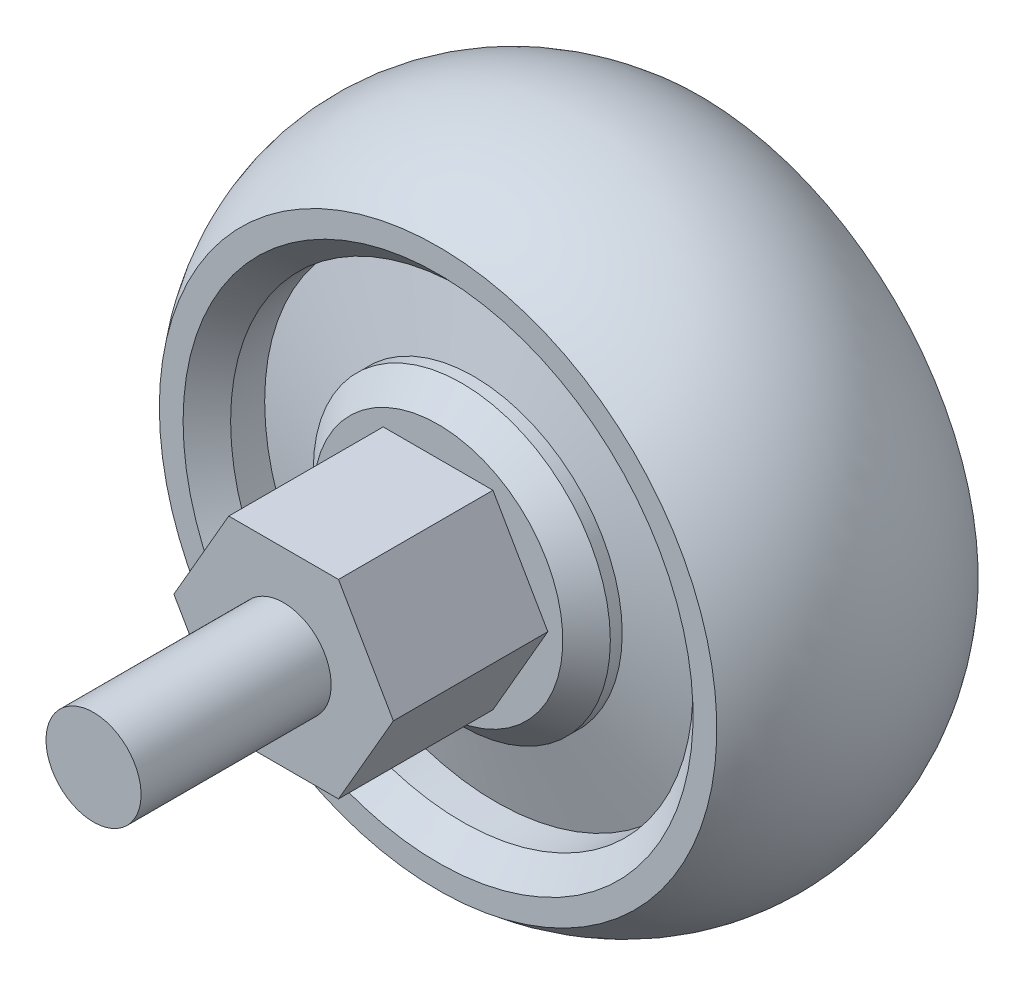
ISO-10303-21;
HEADER;
FILE_DESCRIPTION(('STEP AP214'),'2;1');
FILE_NAME('part.step','',(''),(''),'','','');
FILE_SCHEMA(('AUTOMOTIVE_DESIGN { 1 0 10303 214 1 1 1 1 }'));
ENDSEC;
DATA;
#1=APPLICATION_CONTEXT('core data for automotive mechanical design processes');
#2=APPLICATION_PROTOCOL_DEFINITION('international standard','automotive_design',2000,#1);
#3=PRODUCT_CONTEXT('',#1,'mechanical');
#4=PRODUCT('Part','Part','',(#3));
#5=PRODUCT_RELATED_PRODUCT_CATEGORY('part','',(#4));
#6=PRODUCT_DEFINITION_FORMATION('','',#4);
#7=PRODUCT_DEFINITION_CONTEXT('part definition',#1,'design');
#8=PRODUCT_DEFINITION('design','',#6,#7);
#9=PRODUCT_DEFINITION_SHAPE('','',#8);
#10=(LENGTH_UNIT() NAMED_UNIT(*) SI_UNIT(.MILLI.,.METRE.));
#11=(NAMED_UNIT(*) PLANE_ANGLE_UNIT() SI_UNIT($,.RADIAN.));
#12=(NAMED_UNIT(*) SI_UNIT($,.STERADIAN.) SOLID_ANGLE_UNIT());
#13=UNCERTAINTY_MEASURE_WITH_UNIT(LENGTH_MEASURE(1.E-05),#10,'distance_accuracy_value','');
#14=(GEOMETRIC_REPRESENTATION_CONTEXT(3) GLOBAL_UNCERTAINTY_ASSIGNED_CONTEXT((#13)) GLOBAL_UNIT_ASSIGNED_CONTEXT((#10,
#11,#12)) REPRESENTATION_CONTEXT('',''));
#15=CARTESIAN_POINT('',(0.,0.,0.));
#16=DIRECTION('',(0.,0.,1.));
#17=DIRECTION('',(1.,0.,0.));
#18=AXIS2_PLACEMENT_3D('',#15,#16,#17);
#19=CARTESIAN_POINT('',(0.,0.,0.));
#20=DIRECTION('',(0.,0.,-1.));
#21=DIRECTION('',(-1.,0.,0.));
#22=AXIS2_PLACEMENT_3D('',#19,#20,#21);
#23=CYLINDRICAL_SURFACE('',#22,24.716081373956);
#24=CARTESIAN_POINT('',(0.,0.,7.79103938563071));
#25=DIRECTION('',(0.,0.,-1.));
#26=DIRECTION('',(-1.,0.,0.));
#27=AXIS2_PLACEMENT_3D('',#24,#25,#26);
#28=CIRCLE('',#27,24.716081373956);
#29=CARTESIAN_POINT('',(-24.716081373956,0.,7.79103938563071));
#30=VERTEX_POINT('',#29);
#31=EDGE_CURVE('E170',#30,#30,#28,.T.);
#32=ORIENTED_EDGE('',*,*,#31,.T.);
#33=EDGE_LOOP('',(#32));
#34=FACE_BOUND('',#33,.T.);
#35=CARTESIAN_POINT('',(0.,0.,11.43));
#36=DIRECTION('',(0.,0.,-1.));
#37=DIRECTION('',(-1.,0.,0.));
#38=AXIS2_PLACEMENT_3D('',#35,#36,#37);
#39=CIRCLE('',#38,24.716081373956);
#40=CARTESIAN_POINT('',(-24.716081373956,0.,11.43));
#41=VERTEX_POINT('',#40);
#42=EDGE_CURVE('E247',#41,#41,#39,.F.);
#43=ORIENTED_EDGE('',*,*,#42,.T.);
#44=EDGE_LOOP('',(#43));
#45=FACE_BOUND('',#44,.T.);
#46=ADVANCED_FACE('F15',(#34,#45),#23,.F.);
#47=CARTESIAN_POINT('',(0.,0.,7.79103938563071));
#48=DIRECTION('',(0.,0.,-1.));
#49=DIRECTION('',(-1.,0.,0.));
#50=AXIS2_PLACEMENT_3D('',#47,#48,#49);
#51=CONICAL_SURFACE('',#50,24.716081373956,1.30899693899575);
#52=CARTESIAN_POINT('',(0.,0.,10.16));
#53=DIRECTION('',(0.,0.,-1.));
#54=DIRECTION('',(-1.,0.,0.));
#55=AXIS2_PLACEMENT_3D('',#52,#53,#54);
#56=CIRCLE('',#55,15.875);
#57=CARTESIAN_POINT('',(-15.875,0.,10.16));
#58=VERTEX_POINT('',#57);
#59=EDGE_CURVE('E166',#58,#58,#56,.T.);
#60=ORIENTED_EDGE('',*,*,#59,.T.);
#61=EDGE_LOOP('',(#60));
#62=FACE_BOUND('',#61,.T.);
#63=ORIENTED_EDGE('',*,*,#31,.F.);
#64=EDGE_LOOP('',(#63));
#65=FACE_BOUND('',#64,.T.);
#66=ADVANCED_FACE('F209',(#62,#65),#51,.T.);
#67=CARTESIAN_POINT('',(0.,0.,0.));
#68=DIRECTION('',(0.,0.,-1.));
#69=DIRECTION('',(-1.,0.,0.));
#70=AXIS2_PLACEMENT_3D('',#67,#68,#69);
#71=CYLINDRICAL_SURFACE('',#70,15.875);
#72=CARTESIAN_POINT('',(0.,0.,11.43));
#73=DIRECTION('',(0.,0.,-1.));
#74=DIRECTION('',(-1.,0.,0.));
#75=AXIS2_PLACEMENT_3D('',#72,#73,#74);
#76=CIRCLE('',#75,15.875);
#77=CARTESIAN_POINT('',(-15.875,0.,11.43));
#78=VERTEX_POINT('',#77);
#79=EDGE_CURVE('E10',#78,#78,#76,.T.);
#80=ORIENTED_EDGE('',*,*,#79,.T.);
#81=EDGE_LOOP('',(#80));
#82=FACE_BOUND('',#81,.T.);
#83=ORIENTED_EDGE('',*,*,#59,.F.);
#84=EDGE_LOOP('',(#83));
#85=FACE_BOUND('',#84,.T.);
#86=ADVANCED_FACE('F216',(#82,#85),#71,.T.);
#87=CARTESIAN_POINT('',(5.86587873496661,10.16,-30.9312806053457));
#88=DIRECTION('',(0.,1.,0.));
#89=DIRECTION('',(0.,0.,1.));
#90=AXIS2_PLACEMENT_3D('',#87,#88,#89);
#91=PLANE('',#90);
#92=DIRECTION('',(-1.,0.,0.));
#93=VECTOR('',#92,1.);
#94=CARTESIAN_POINT('',(5.86587873496661,10.16,13.97));
#95=LINE('',#94,#93);
#96=CARTESIAN_POINT('',(5.86587873496661,10.16,13.97));
#97=VERTEX_POINT('',#96);
#98=CARTESIAN_POINT('',(-5.86587873496669,10.16,13.97));
#99=VERTEX_POINT('',#98);
#100=EDGE_CURVE('E99',#97,#99,#95,.T.);
#101=ORIENTED_EDGE('',*,*,#100,.T.);
#102=DIRECTION('',(0.,0.,1.));
#103=VECTOR('',#102,1.);
#104=CARTESIAN_POINT('',(-5.86587873496669,10.16,-30.9312806053457));
#105=LINE('',#104,#103);
#106=CARTESIAN_POINT('',(-5.86587873496669,10.16,30.48));
#107=VERTEX_POINT('',#106);
#108=EDGE_CURVE('E85',#99,#107,#105,.T.);
#109=ORIENTED_EDGE('',*,*,#108,.T.);
#110=DIRECTION('',(-1.,0.,0.));
#111=VECTOR('',#110,1.);
#112=CARTESIAN_POINT('',(5.86587873496661,10.16,30.48));
#113=LINE('',#112,#111);
#114=CARTESIAN_POINT('',(5.86587873496661,10.16,30.48));
#115=VERTEX_POINT('',#114);
#116=EDGE_CURVE('E116',#115,#107,#113,.T.);
#117=ORIENTED_EDGE('',*,*,#116,.F.);
#118=DIRECTION('',(0.,0.,1.));
#119=VECTOR('',#118,1.);
#120=CARTESIAN_POINT('',(5.86587873496661,10.16,-30.9312806053457));
#121=LINE('',#120,#119);
#122=EDGE_CURVE('E105',#97,#115,#121,.T.);
#123=ORIENTED_EDGE('',*,*,#122,.F.);
#124=EDGE_LOOP('',(#101,#109,#117,#123));
#125=FACE_BOUND('',#124,.T.);
#126=ADVANCED_FACE('F104',(#125),#91,.T.);
#127=CARTESIAN_POINT('',(11.7317574699332,0.,-30.9312806053457));
#128=DIRECTION('',(0.86602540378444,0.500000000000001,0.));
#129=DIRECTION('',(-0.500000000000001,0.86602540378444,0.));
#130=AXIS2_PLACEMENT_3D('',#127,#128,#129);
#131=PLANE('',#130);
#132=DIRECTION('',(-0.500000000000001,0.86602540378444,0.));
#133=VECTOR('',#132,1.);
#134=CARTESIAN_POINT('',(11.7317574699332,0.,13.97));
#135=LINE('',#134,#133);
#136=CARTESIAN_POINT('',(11.7317574699332,0.,13.97));
#137=VERTEX_POINT('',#136);
#138=EDGE_CURVE('E108',#137,#97,#135,.T.);
#139=ORIENTED_EDGE('',*,*,#138,.T.);
#140=ORIENTED_EDGE('',*,*,#122,.T.);
#141=DIRECTION('',(-0.500000000000001,0.86602540378444,0.));
#142=VECTOR('',#141,1.);
#143=CARTESIAN_POINT('',(11.7317574699332,0.,30.48));
#144=LINE('',#143,#142);
#145=CARTESIAN_POINT('',(11.7317574699332,0.,30.48));
#146=VERTEX_POINT('',#145);
#147=EDGE_CURVE('E136',#146,#115,#144,.T.);
#148=ORIENTED_EDGE('',*,*,#147,.F.);
#149=DIRECTION('',(0.,0.,1.));
#150=VECTOR('',#149,1.);
#151=CARTESIAN_POINT('',(11.7317574699332,0.,-30.9312806053457));
#152=LINE('',#151,#150);
#153=EDGE_CURVE('E133',#137,#146,#152,.T.);
#154=ORIENTED_EDGE('',*,*,#153,.F.);
#155=EDGE_LOOP('',(#139,#140,#148,#154));
#156=FACE_BOUND('',#155,.T.);
#157=ADVANCED_FACE('F463',(#156),#131,.T.);
#158=CARTESIAN_POINT('',(5.86587873496661,-10.16,-30.9312806053457));
#159=DIRECTION('',(0.86602540378444,-0.500000000000001,0.));
#160=DIRECTION('',(0.500000000000001,0.86602540378444,0.));
#161=AXIS2_PLACEMENT_3D('',#158,#159,#160);
#162=PLANE('',#161);
#163=DIRECTION('',(0.500000000000001,0.86602540378444,0.));
#164=VECTOR('',#163,1.);
#165=CARTESIAN_POINT('',(5.86587873496661,-10.16,13.97));
#166=LINE('',#165,#164);
#167=CARTESIAN_POINT('',(5.86587873496661,-10.16,13.97));
#168=VERTEX_POINT('',#167);
#169=EDGE_CURVE('E119',#168,#137,#166,.T.);
#170=ORIENTED_EDGE('',*,*,#169,.T.);
#171=ORIENTED_EDGE('',*,*,#153,.T.);
#172=DIRECTION('',(0.500000000000001,0.86602540378444,0.));
#173=VECTOR('',#172,1.);
#174=CARTESIAN_POINT('',(5.86587873496661,-10.16,30.48));
#175=LINE('',#174,#173);
#176=CARTESIAN_POINT('',(5.86587873496661,-10.16,30.48));
#177=VERTEX_POINT('',#176);
#178=EDGE_CURVE('E140',#177,#146,#175,.T.);
#179=ORIENTED_EDGE('',*,*,#178,.F.);
#180=DIRECTION('',(0.,0.,1.));
#181=VECTOR('',#180,1.);
#182=CARTESIAN_POINT('',(5.86587873496661,-10.16,-30.9312806053457));
#183=LINE('',#182,#181);
#184=EDGE_CURVE('E137',#168,#177,#183,.T.);
#185=ORIENTED_EDGE('',*,*,#184,.F.);
#186=EDGE_LOOP('',(#170,#171,#179,#185));
#187=FACE_BOUND('',#186,.T.);
#188=ADVANCED_FACE('F475',(#187),#162,.T.);
#189=CARTESIAN_POINT('',(-5.86587873496661,-10.16,-30.9312806053457));
#190=DIRECTION('',(0.,-1.,0.));
#191=DIRECTION('',(1.,0.,0.));
#192=AXIS2_PLACEMENT_3D('',#189,#190,#191);
#193=PLANE('',#192);
#194=DIRECTION('',(1.,0.,0.));
#195=VECTOR('',#194,1.);
#196=CARTESIAN_POINT('',(-5.86587873496661,-10.16,13.97));
#197=LINE('',#196,#195);
#198=CARTESIAN_POINT('',(-5.86587873496661,-10.16,13.97));
#199=VERTEX_POINT('',#198);
#200=EDGE_CURVE('E124',#199,#168,#197,.T.);
#201=ORIENTED_EDGE('',*,*,#200,.T.);
#202=ORIENTED_EDGE('',*,*,#184,.T.);
#203=DIRECTION('',(1.,0.,0.));
#204=VECTOR('',#203,1.);
#205=CARTESIAN_POINT('',(-5.86587873496661,-10.16,30.48));
#206=LINE('',#205,#204);
#207=CARTESIAN_POINT('',(-5.86587873496661,-10.16,30.48));
#208=VERTEX_POINT('',#207);
#209=EDGE_CURVE('E144',#208,#177,#206,.T.);
#210=ORIENTED_EDGE('',*,*,#209,.F.);
#211=DIRECTION('',(0.,0.,1.));
#212=VECTOR('',#211,1.);
#213=CARTESIAN_POINT('',(-5.86587873496661,-10.16,-30.9312806053457));
#214=LINE('',#213,#212);
#215=EDGE_CURVE('E141',#199,#208,#214,.T.);
#216=ORIENTED_EDGE('',*,*,#215,.F.);
#217=EDGE_LOOP('',(#201,#202,#210,#216));
#218=FACE_BOUND('',#217,.T.);
#219=ADVANCED_FACE('F487',(#218),#193,.T.);
#220=CARTESIAN_POINT('',(-11.7317574699332,0.,-30.9312806053457));
#221=DIRECTION('',(-0.86602540378444,-0.500000000000001,0.));
#222=DIRECTION('',(0.500000000000001,-0.86602540378444,0.));
#223=AXIS2_PLACEMENT_3D('',#220,#221,#222);
#224=PLANE('',#223);
#225=DIRECTION('',(0.500000000000001,-0.86602540378444,0.));
#226=VECTOR('',#225,1.);
#227=CARTESIAN_POINT('',(-11.7317574699332,0.,13.97));
#228=LINE('',#227,#226);
#229=CARTESIAN_POINT('',(-11.7317574699332,0.,13.97));
#230=VERTEX_POINT('',#229);
#231=EDGE_CURVE('E101',#230,#199,#228,.T.);
#232=ORIENTED_EDGE('',*,*,#231,.T.);
#233=ORIENTED_EDGE('',*,*,#215,.T.);
#234=DIRECTION('',(0.500000000000001,-0.86602540378444,0.));
#235=VECTOR('',#234,1.);
#236=CARTESIAN_POINT('',(-11.7317574699332,0.,30.48));
#237=LINE('',#236,#235);
#238=CARTESIAN_POINT('',(-11.7317574699332,0.,30.48));
#239=VERTEX_POINT('',#238);
#240=EDGE_CURVE('E36',#239,#208,#237,.T.);
#241=ORIENTED_EDGE('',*,*,#240,.F.);
#242=DIRECTION('',(0.,0.,1.));
#243=VECTOR('',#242,1.);
#244=CARTESIAN_POINT('',(-11.7317574699332,0.,-30.9312806053457));
#245=LINE('',#244,#243);
#246=EDGE_CURVE('E42',#230,#239,#245,.T.);
#247=ORIENTED_EDGE('',*,*,#246,.F.);
#248=EDGE_LOOP('',(#232,#233,#241,#247));
#249=FACE_BOUND('',#248,.T.);
#250=ADVANCED_FACE('F500',(#249),#224,.T.);
#251=CARTESIAN_POINT('',(-5.86587873496669,10.16,-30.9312806053457));
#252=DIRECTION('',(-0.86602540378444,0.500000000000001,0.));
#253=DIRECTION('',(-0.500000000000001,-0.86602540378444,0.));
#254=AXIS2_PLACEMENT_3D('',#251,#252,#253);
#255=PLANE('',#254);
#256=DIRECTION('',(-0.500000000000001,-0.86602540378444,0.));
#257=VECTOR('',#256,1.);
#258=CARTESIAN_POINT('',(-5.86587873496669,10.16,13.97));
#259=LINE('',#258,#257);
#260=EDGE_CURVE('E88',#99,#230,#259,.T.);
#261=ORIENTED_EDGE('',*,*,#260,.T.);
#262=ORIENTED_EDGE('',*,*,#246,.T.);
#263=DIRECTION('',(-0.500000000000001,-0.86602540378444,0.));
#264=VECTOR('',#263,1.);
#265=CARTESIAN_POINT('',(-5.86587873496669,10.16,30.48));
#266=LINE('',#265,#264);
#267=EDGE_CURVE('E90',#107,#239,#266,.T.);
#268=ORIENTED_EDGE('',*,*,#267,.F.);
#269=ORIENTED_EDGE('',*,*,#108,.F.);
#270=EDGE_LOOP('',(#261,#262,#268,#269));
#271=FACE_BOUND('',#270,.T.);
#272=ADVANCED_FACE('F87',(#271),#255,.T.);
#273=CARTESIAN_POINT('',(0.,0.,13.97));
#274=DIRECTION('',(0.,0.,-1.));
#275=DIRECTION('',(-1.,0.,0.));
#276=AXIS2_PLACEMENT_3D('',#273,#274,#275);
#277=PLANE('',#276);
#278=CARTESIAN_POINT('',(0.,0.,13.97));
#279=DIRECTION('',(0.,0.,-1.));
#280=DIRECTION('',(-1.,0.,0.));
#281=AXIS2_PLACEMENT_3D('',#278,#279,#280);
#282=CIRCLE('',#281,13.335);
#283=CARTESIAN_POINT('',(-13.335,0.,13.97));
#284=VERTEX_POINT('',#283);
#285=EDGE_CURVE('E24',#284,#284,#282,.F.);
#286=ORIENTED_EDGE('',*,*,#285,.T.);
#287=EDGE_LOOP('',(#286));
#288=FACE_BOUND('',#287,.T.);
#289=ORIENTED_EDGE('',*,*,#138,.F.);
#290=ORIENTED_EDGE('',*,*,#169,.F.);
#291=ORIENTED_EDGE('',*,*,#200,.F.);
#292=ORIENTED_EDGE('',*,*,#231,.F.);
#293=ORIENTED_EDGE('',*,*,#260,.F.);
#294=ORIENTED_EDGE('',*,*,#100,.F.);
#295=EDGE_LOOP('',(#289,#290,#291,#292,#293,#294));
#296=FACE_BOUND('',#295,.T.);
#297=ADVANCED_FACE('F98',(#288,#296),#277,.F.);
#298=CARTESIAN_POINT('',(0.,0.,50.8));
#299=DIRECTION('',(0.,0.,1.));
#300=DIRECTION('',(1.,0.,0.));
#301=AXIS2_PLACEMENT_3D('',#298,#299,#300);
#302=PLANE('',#301);
#303=CARTESIAN_POINT('',(0.,0.,50.8));
#304=DIRECTION('',(0.,0.,-1.));
#305=DIRECTION('',(-1.,0.,0.));
#306=AXIS2_PLACEMENT_3D('',#303,#304,#305);
#307=CIRCLE('',#306,5.07999999999999);
#308=CARTESIAN_POINT('',(-5.08,0.,50.8));
#309=VERTEX_POINT('',#308);
#310=EDGE_CURVE('E158',#309,#309,#307,.T.);
#311=ORIENTED_EDGE('',*,*,#310,.F.);
#312=EDGE_LOOP('',(#311));
#313=FACE_BOUND('',#312,.T.);
#314=ADVANCED_FACE('F535',(#313),#302,.T.);
#315=CARTESIAN_POINT('',(0.,0.,0.));
#316=DIRECTION('',(0.,0.,-1.));
#317=DIRECTION('',(-1.,0.,0.));
#318=AXIS2_PLACEMENT_3D('',#315,#316,#317);
#319=CYLINDRICAL_SURFACE('',#318,5.08);
#320=ORIENTED_EDGE('',*,*,#310,.T.);
#321=EDGE_LOOP('',(#320));
#322=FACE_BOUND('',#321,.T.);
#323=CARTESIAN_POINT('',(0.,0.,30.48));
#324=DIRECTION('',(0.,0.,-1.));
#325=DIRECTION('',(-1.,0.,0.));
#326=AXIS2_PLACEMENT_3D('',#323,#324,#325);
#327=CIRCLE('',#326,5.08);
#328=CARTESIAN_POINT('',(-5.08,0.,30.48));
#329=VERTEX_POINT('',#328);
#330=EDGE_CURVE('E162',#329,#329,#327,.T.);
#331=ORIENTED_EDGE('',*,*,#330,.F.);
#332=EDGE_LOOP('',(#331));
#333=FACE_BOUND('',#332,.T.);
#334=ADVANCED_FACE('F204',(#322,#333),#319,.T.);
#335=CARTESIAN_POINT('',(0.,0.,30.48));
#336=DIRECTION('',(0.,0.,1.));
#337=DIRECTION('',(1.,0.,0.));
#338=AXIS2_PLACEMENT_3D('',#335,#336,#337);
#339=PLANE('',#338);
#340=ORIENTED_EDGE('',*,*,#330,.T.);
#341=EDGE_LOOP('',(#340));
#342=FACE_BOUND('',#341,.T.);
#343=ORIENTED_EDGE('',*,*,#147,.T.);
#344=ORIENTED_EDGE('',*,*,#116,.T.);
#345=ORIENTED_EDGE('',*,*,#267,.T.);
#346=ORIENTED_EDGE('',*,*,#240,.T.);
#347=ORIENTED_EDGE('',*,*,#209,.T.);
#348=ORIENTED_EDGE('',*,*,#178,.T.);
#349=EDGE_LOOP('',(#343,#344,#345,#346,#347,#348));
#350=FACE_BOUND('',#349,.T.);
#351=ADVANCED_FACE('F194',(#342,#350),#339,.T.);
#352=CARTESIAN_POINT('',(0.,0.,13.97));
#353=DIRECTION('',(0.,0.,-1.));
#354=DIRECTION('',(-1.,0.,0.));
#355=AXIS2_PLACEMENT_3D('',#352,#353,#354);
#356=CONICAL_SURFACE('',#355,13.335,0.785398163397444);
#357=ORIENTED_EDGE('',*,*,#79,.F.);
#358=EDGE_LOOP('',(#357));
#359=FACE_BOUND('',#358,.T.);
#360=ORIENTED_EDGE('',*,*,#285,.F.);
#361=EDGE_LOOP('',(#360));
#362=FACE_BOUND('',#361,.T.);
#363=ADVANCED_FACE('F17',(#359,#362),#356,.T.);
#364=CARTESIAN_POINT('',(0.,0.,13.97));
#365=DIRECTION('',(0.,0.,1.));
#366=DIRECTION('',(1.,0.,0.));
#367=AXIS2_PLACEMENT_3D('',#364,#365,#366);
#368=CONICAL_SURFACE('',#367,27.256081373956,0.785398163397446);
#369=ORIENTED_EDGE('',*,*,#42,.F.);
#370=EDGE_LOOP('',(#369));
#371=FACE_BOUND('',#370,.T.);
#372=CARTESIAN_POINT('',(0.,0.,13.97));
#373=DIRECTION('',(0.,0.,-1.));
#374=DIRECTION('',(-1.,0.,0.));
#375=AXIS2_PLACEMENT_3D('',#372,#373,#374);
#376=CIRCLE('',#375,27.256081373956);
#377=CARTESIAN_POINT('',(-27.256081373956,0.,13.97));
#378=VERTEX_POINT('',#377);
#379=EDGE_CURVE('E244',#378,#378,#376,.T.);
#380=ORIENTED_EDGE('',*,*,#379,.F.);
#381=EDGE_LOOP('',(#380));
#382=FACE_BOUND('',#381,.T.);
#383=ADVANCED_FACE('F193',(#371,#382),#368,.F.);
#384=CARTESIAN_POINT('',(0.,0.,13.97));
#385=DIRECTION('',(0.,0.,-1.));
#386=DIRECTION('',(-1.,0.,0.));
#387=AXIS2_PLACEMENT_3D('',#384,#385,#386);
#388=PLANE('',#387);
#389=ORIENTED_EDGE('',*,*,#379,.T.);
#390=EDGE_LOOP('',(#389));
#391=FACE_BOUND('',#390,.T.);
#392=CARTESIAN_POINT('',(0.,0.,13.97));
#393=DIRECTION('',(0.,0.,-1.));
#394=DIRECTION('',(-1.,0.,0.));
#395=AXIS2_PLACEMENT_3D('',#392,#393,#394);
#396=CIRCLE('',#395,29.796081373956);
#397=CARTESIAN_POINT('',(-29.796081373956,0.,13.97));
#398=VERTEX_POINT('',#397);
#399=EDGE_CURVE('E150',#398,#398,#396,.T.);
#400=ORIENTED_EDGE('',*,*,#399,.F.);
#401=EDGE_LOOP('',(#400));
#402=FACE_BOUND('',#401,.T.);
#403=ADVANCED_FACE('F201',(#391,#402),#388,.F.);
#404=CARTESIAN_POINT('',(0.,0.,0.));
#405=DIRECTION('',(0.,0.,-1.));
#406=DIRECTION('',(-1.,0.,0.));
#407=AXIS2_PLACEMENT_3D('',#404,#405,#406);
#408=DEGENERATE_TOROIDAL_SURFACE('',#407,13.335,21.59,.T.);
#409=CARTESIAN_POINT('',(0.,0.,-13.97));
#410=DIRECTION('',(0.,0.,-1.));
#411=DIRECTION('',(-1.,0.,0.));
#412=AXIS2_PLACEMENT_3D('',#409,#410,#411);
#413=CIRCLE('',#412,29.796081373956);
#414=CARTESIAN_POINT('',(-29.796081373956,0.,-13.97));
#415=VERTEX_POINT('',#414);
#416=EDGE_CURVE('E123',#415,#415,#413,.T.);
#417=ORIENTED_EDGE('',*,*,#416,.F.);
#418=EDGE_LOOP('',(#417));
#419=FACE_BOUND('',#418,.T.);
#420=ORIENTED_EDGE('',*,*,#399,.T.);
#421=EDGE_LOOP('',(#420));
#422=FACE_BOUND('',#421,.T.);
#423=ADVANCED_FACE('F342',(#419,#422),#408,.T.);
#424=CARTESIAN_POINT('',(0.,0.,-13.97));
#425=DIRECTION('',(0.,0.,1.));
#426=DIRECTION('',(1.,0.,0.));
#427=AXIS2_PLACEMENT_3D('',#424,#425,#426);
#428=PLANE('',#427);
#429=CARTESIAN_POINT('',(0.,0.,-13.97));
#430=DIRECTION('',(0.,0.,1.));
#431=DIRECTION('',(1.,0.,0.));
#432=AXIS2_PLACEMENT_3D('',#429,#430,#431);
#433=CIRCLE('',#432,27.256081373956);
#434=CARTESIAN_POINT('',(27.256081373956,0.,-13.97));
#435=VERTEX_POINT('',#434);
#436=EDGE_CURVE('E237',#435,#435,#433,.T.);
#437=ORIENTED_EDGE('',*,*,#436,.T.);
#438=EDGE_LOOP('',(#437));
#439=FACE_BOUND('',#438,.T.);
#440=ORIENTED_EDGE('',*,*,#416,.T.);
#441=EDGE_LOOP('',(#440));
#442=FACE_BOUND('',#441,.T.);
#443=ADVANCED_FACE('F299',(#439,#442),#428,.F.);
#444=CARTESIAN_POINT('',(0.,0.,-11.43));
#445=DIRECTION('',(0.,0.,-1.));
#446=DIRECTION('',(-1.,0.,0.));
#447=AXIS2_PLACEMENT_3D('',#444,#445,#446);
#448=CONICAL_SURFACE('',#447,24.716081373956,0.78539816339745);
#449=ORIENTED_EDGE('',*,*,#436,.F.);
#450=EDGE_LOOP('',(#449));
#451=FACE_BOUND('',#450,.T.);
#452=CARTESIAN_POINT('',(0.,0.,-11.43));
#453=DIRECTION('',(0.,0.,1.));
#454=DIRECTION('',(1.,0.,0.));
#455=AXIS2_PLACEMENT_3D('',#452,#453,#454);
#456=CIRCLE('',#455,24.716081373956);
#457=CARTESIAN_POINT('',(24.716081373956,0.,-11.43));
#458=VERTEX_POINT('',#457);
#459=EDGE_CURVE('E132',#458,#458,#456,.F.);
#460=ORIENTED_EDGE('',*,*,#459,.F.);
#461=EDGE_LOOP('',(#460));
#462=FACE_BOUND('',#461,.T.);
#463=ADVANCED_FACE('F292',(#451,#462),#448,.F.);
#464=CARTESIAN_POINT('',(0.,0.,-13.97));
#465=DIRECTION('',(0.,0.,-1.));
#466=DIRECTION('',(-1.,0.,0.));
#467=AXIS2_PLACEMENT_3D('',#464,#465,#466);
#468=PLANE('',#467);
#469=CARTESIAN_POINT('',(0.,0.,-13.97));
#470=DIRECTION('',(0.,0.,-1.));
#471=DIRECTION('',(-1.,0.,0.));
#472=AXIS2_PLACEMENT_3D('',#469,#470,#471);
#473=CIRCLE('',#472,13.335);
#474=CARTESIAN_POINT('',(-13.335,0.,-13.97));
#475=VERTEX_POINT('',#474);
#476=EDGE_CURVE('E178',#475,#475,#473,.T.);
#477=ORIENTED_EDGE('',*,*,#476,.T.);
#478=EDGE_LOOP('',(#477));
#479=FACE_BOUND('',#478,.T.);
#480=ADVANCED_FACE('F298',(#479),#468,.T.);
#481=CARTESIAN_POINT('',(0.,0.,-13.97));
#482=DIRECTION('',(0.,0.,1.));
#483=DIRECTION('',(1.,0.,0.));
#484=AXIS2_PLACEMENT_3D('',#481,#482,#483);
#485=CONICAL_SURFACE('',#484,13.335,0.785398163397448);
#486=CARTESIAN_POINT('',(0.,0.,-11.43));
#487=DIRECTION('',(0.,0.,-1.));
#488=DIRECTION('',(-1.,0.,0.));
#489=AXIS2_PLACEMENT_3D('',#486,#487,#488);
#490=CIRCLE('',#489,15.875);
#491=CARTESIAN_POINT('',(-15.875,0.,-11.43));
#492=VERTEX_POINT('',#491);
#493=EDGE_CURVE('E182',#492,#492,#490,.F.);
#494=ORIENTED_EDGE('',*,*,#493,.F.);
#495=EDGE_LOOP('',(#494));
#496=FACE_BOUND('',#495,.T.);
#497=ORIENTED_EDGE('',*,*,#476,.F.);
#498=EDGE_LOOP('',(#497));
#499=FACE_BOUND('',#498,.T.);
#500=ADVANCED_FACE('F389',(#496,#499),#485,.T.);
#501=CARTESIAN_POINT('',(0.,0.,0.));
#502=DIRECTION('',(0.,0.,-1.));
#503=DIRECTION('',(-1.,0.,0.));
#504=AXIS2_PLACEMENT_3D('',#501,#502,#503);
#505=CYLINDRICAL_SURFACE('',#504,15.875);
#506=ORIENTED_EDGE('',*,*,#493,.T.);
#507=EDGE_LOOP('',(#506));
#508=FACE_BOUND('',#507,.T.);
#509=CARTESIAN_POINT('',(0.,0.,-10.16));
#510=DIRECTION('',(0.,0.,-1.));
#511=DIRECTION('',(-1.,0.,0.));
#512=AXIS2_PLACEMENT_3D('',#509,#510,#511);
#513=CIRCLE('',#512,15.875);
#514=CARTESIAN_POINT('',(-15.875,0.,-10.16));
#515=VERTEX_POINT('',#514);
#516=EDGE_CURVE('E174',#515,#515,#513,.T.);
#517=ORIENTED_EDGE('',*,*,#516,.T.);
#518=EDGE_LOOP('',(#517));
#519=FACE_BOUND('',#518,.T.);
#520=ADVANCED_FACE('F228',(#508,#519),#505,.T.);
#521=CARTESIAN_POINT('',(0.,0.,-10.16));
#522=DIRECTION('',(0.,0.,1.));
#523=DIRECTION('',(1.,0.,0.));
#524=AXIS2_PLACEMENT_3D('',#521,#522,#523);
#525=CONICAL_SURFACE('',#524,15.875,1.30899693899575);
#526=CARTESIAN_POINT('',(0.,0.,-7.79103938563071));
#527=DIRECTION('',(0.,0.,1.));
#528=DIRECTION('',(1.,0.,0.));
#529=AXIS2_PLACEMENT_3D('',#526,#527,#528);
#530=CIRCLE('',#529,24.716081373956);
#531=CARTESIAN_POINT('',(24.716081373956,0.,-7.79103938563071));
#532=VERTEX_POINT('',#531);
#533=EDGE_CURVE('E154',#532,#532,#530,.F.);
#534=ORIENTED_EDGE('',*,*,#533,.T.);
#535=EDGE_LOOP('',(#534));
#536=FACE_BOUND('',#535,.T.);
#537=ORIENTED_EDGE('',*,*,#516,.F.);
#538=EDGE_LOOP('',(#537));
#539=FACE_BOUND('',#538,.T.);
#540=ADVANCED_FACE('F223',(#536,#539),#525,.T.);
#541=ORIENTED_EDGE('',*,*,#533,.F.);
#542=EDGE_LOOP('',(#541));
#543=FACE_BOUND('',#542,.T.);
#544=ORIENTED_EDGE('',*,*,#459,.T.);
#545=EDGE_LOOP('',(#544));
#546=FACE_BOUND('',#545,.T.);
#547=ADVANCED_FACE('F212',(#543,#546),#23,.F.);
#548=CLOSED_SHELL('',(#46,#66,#86,#126,#157,#188,#219,#250,#272,#297,#314,#334,#351,#363,#383,
#403,#423,#443,#463,#480,#500,#520,#540,#547));
#549=MANIFOLD_SOLID_BREP('B1',#548);
#550=ADVANCED_BREP_SHAPE_REPRESENTATION('',(#18,#549),#14);
#551=SHAPE_DEFINITION_REPRESENTATION(#9,#550);
ENDSEC;
END-ISO-10303-21;
